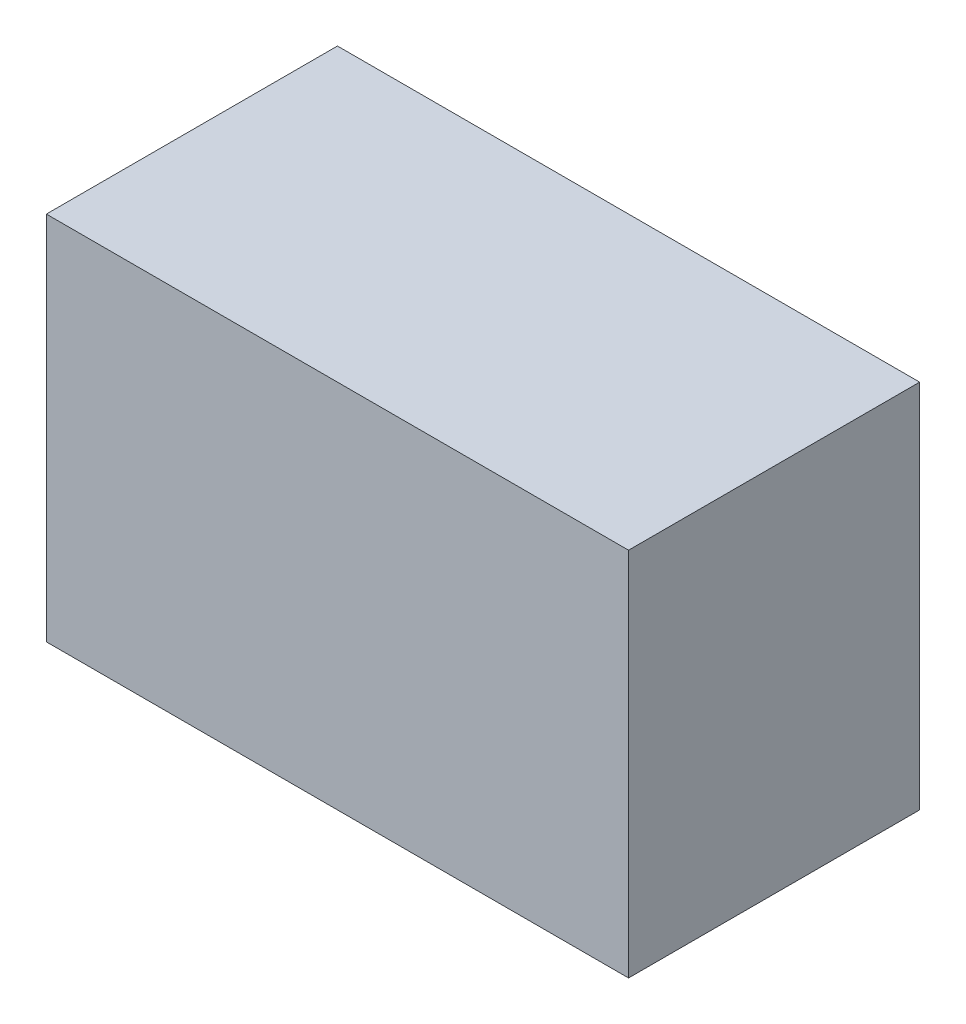
ISO-10303-21;
HEADER;
FILE_DESCRIPTION(('STEP AP214'),'2;1');
FILE_NAME('part.step','',(''),(''),'','','');
FILE_SCHEMA(('AUTOMOTIVE_DESIGN { 1 0 10303 214 1 1 1 1 }'));
ENDSEC;
DATA;
#1=APPLICATION_CONTEXT('core data for automotive mechanical design processes');
#2=APPLICATION_PROTOCOL_DEFINITION('international standard','automotive_design',2000,#1);
#3=PRODUCT_CONTEXT('',#1,'mechanical');
#4=PRODUCT('Part','Part','',(#3));
#5=PRODUCT_RELATED_PRODUCT_CATEGORY('part','',(#4));
#6=PRODUCT_DEFINITION_FORMATION('','',#4);
#7=PRODUCT_DEFINITION_CONTEXT('part definition',#1,'design');
#8=PRODUCT_DEFINITION('design','',#6,#7);
#9=PRODUCT_DEFINITION_SHAPE('','',#8);
#10=(LENGTH_UNIT() NAMED_UNIT(*) SI_UNIT(.MILLI.,.METRE.));
#11=(NAMED_UNIT(*) PLANE_ANGLE_UNIT() SI_UNIT($,.RADIAN.));
#12=(NAMED_UNIT(*) SI_UNIT($,.STERADIAN.) SOLID_ANGLE_UNIT());
#13=UNCERTAINTY_MEASURE_WITH_UNIT(LENGTH_MEASURE(1.E-05),#10,'distance_accuracy_value','');
#14=(GEOMETRIC_REPRESENTATION_CONTEXT(3) GLOBAL_UNCERTAINTY_ASSIGNED_CONTEXT((#13)) GLOBAL_UNIT_ASSIGNED_CONTEXT((#10,
#11,#12)) REPRESENTATION_CONTEXT('',''));
#15=CARTESIAN_POINT('',(0.,0.,0.));
#16=DIRECTION('',(0.,0.,1.));
#17=DIRECTION('',(1.,0.,0.));
#18=AXIS2_PLACEMENT_3D('',#15,#16,#17);
#19=CARTESIAN_POINT('',(0.54999636,0.35000184,0.5499989));
#20=DIRECTION('',(0.,0.,1.));
#21=DIRECTION('',(1.,0.,0.));
#22=AXIS2_PLACEMENT_3D('',#19,#20,#21);
#23=PLANE('',#22);
#24=DIRECTION('',(1.,0.,0.));
#25=VECTOR('',#24,1.);
#26=CARTESIAN_POINT('',(0.55000398,-0.3499993,0.5499989));
#27=LINE('',#26,#25);
#28=CARTESIAN_POINT('',(0.550003979999991,-0.3499993,0.5499989));
#29=VERTEX_POINT('',#28);
#30=CARTESIAN_POINT('',(-0.55000398,-0.3499993,0.5499989));
#31=VERTEX_POINT('',#30);
#32=EDGE_CURVE('E57',#29,#31,#27,.F.);
#33=ORIENTED_EDGE('',*,*,#32,.F.);
#34=DIRECTION('',(-1.08856965440673E-05,0.999999999940751,0.));
#35=VECTOR('',#34,1.);
#36=CARTESIAN_POINT('',(0.54999636,0.35000184,0.5499989));
#37=LINE('',#36,#35);
#38=CARTESIAN_POINT('',(0.54999636,0.35000184,0.5499989));
#39=VERTEX_POINT('',#38);
#40=EDGE_CURVE('E70',#39,#29,#37,.F.);
#41=ORIENTED_EDGE('',*,*,#40,.F.);
#42=DIRECTION('',(1.,0.,0.));
#43=VECTOR('',#42,1.);
#44=CARTESIAN_POINT('',(-0.55000398,0.35000184,0.5499989));
#45=LINE('',#44,#43);
#46=CARTESIAN_POINT('',(-0.55000398,0.35000184,0.5499989));
#47=VERTEX_POINT('',#46);
#48=EDGE_CURVE('E19',#47,#39,#45,.T.);
#49=ORIENTED_EDGE('',*,*,#48,.F.);
#50=DIRECTION('',(0.,1.,0.));
#51=VECTOR('',#50,1.);
#52=CARTESIAN_POINT('',(-0.55000398,-0.3499993,0.5499989));
#53=LINE('',#52,#51);
#54=EDGE_CURVE('E52',#31,#47,#53,.T.);
#55=ORIENTED_EDGE('',*,*,#54,.F.);
#56=EDGE_LOOP('',(#33,#41,#49,#55));
#57=FACE_BOUND('',#56,.T.);
#58=ADVANCED_FACE('F16',(#57),#23,.T.);
#59=CARTESIAN_POINT('',(-0.55000398,0.35000184,0.));
#60=DIRECTION('',(0.,1.,0.));
#61=DIRECTION('',(0.,0.,1.));
#62=AXIS2_PLACEMENT_3D('',#59,#60,#61);
#63=PLANE('',#62);
#64=DIRECTION('',(0.,0.,1.));
#65=VECTOR('',#64,1.);
#66=CARTESIAN_POINT('',(0.54999636,0.35000184,0.));
#67=LINE('',#66,#65);
#68=CARTESIAN_POINT('',(0.54999636,0.35000184,0.));
#69=VERTEX_POINT('',#68);
#70=EDGE_CURVE('E65',#69,#39,#67,.T.);
#71=ORIENTED_EDGE('',*,*,#70,.F.);
#72=DIRECTION('',(1.,0.,0.));
#73=VECTOR('',#72,1.);
#74=CARTESIAN_POINT('',(-0.55000398,0.35000184,0.));
#75=LINE('',#74,#73);
#76=CARTESIAN_POINT('',(-0.55000398,0.35000184,0.));
#77=VERTEX_POINT('',#76);
#78=EDGE_CURVE('E73',#69,#77,#75,.F.);
#79=ORIENTED_EDGE('',*,*,#78,.T.);
#80=DIRECTION('',(0.,0.,1.));
#81=VECTOR('',#80,1.);
#82=CARTESIAN_POINT('',(-0.55000398,0.35000184,0.));
#83=LINE('',#82,#81);
#84=EDGE_CURVE('E66',#47,#77,#83,.F.);
#85=ORIENTED_EDGE('',*,*,#84,.F.);
#86=ORIENTED_EDGE('',*,*,#48,.T.);
#87=EDGE_LOOP('',(#71,#79,#85,#86));
#88=FACE_BOUND('',#87,.T.);
#89=ADVANCED_FACE('F63',(#88),#63,.T.);
#90=CARTESIAN_POINT('',(-0.55000398,-0.3499993,0.));
#91=DIRECTION('',(-1.,0.,0.));
#92=DIRECTION('',(0.,0.,1.));
#93=AXIS2_PLACEMENT_3D('',#90,#91,#92);
#94=PLANE('',#93);
#95=ORIENTED_EDGE('',*,*,#84,.T.);
#96=DIRECTION('',(0.,1.,0.));
#97=VECTOR('',#96,1.);
#98=CARTESIAN_POINT('',(-0.55000398,0.35000184,0.));
#99=LINE('',#98,#97);
#100=CARTESIAN_POINT('',(-0.55000398,-0.3499993,0.));
#101=VERTEX_POINT('',#100);
#102=EDGE_CURVE('E76',#77,#101,#99,.F.);
#103=ORIENTED_EDGE('',*,*,#102,.T.);
#104=DIRECTION('',(0.,0.,-1.));
#105=VECTOR('',#104,1.);
#106=CARTESIAN_POINT('',(-0.55000398,-0.3499993,0.));
#107=LINE('',#106,#105);
#108=EDGE_CURVE('E71',#31,#101,#107,.T.);
#109=ORIENTED_EDGE('',*,*,#108,.F.);
#110=ORIENTED_EDGE('',*,*,#54,.T.);
#111=EDGE_LOOP('',(#95,#103,#109,#110));
#112=FACE_BOUND('',#111,.T.);
#113=ADVANCED_FACE('F100',(#112),#94,.T.);
#114=CARTESIAN_POINT('',(0.55000398,-0.3499993,0.));
#115=DIRECTION('',(0.,-1.,0.));
#116=DIRECTION('',(0.,0.,-1.));
#117=AXIS2_PLACEMENT_3D('',#114,#115,#116);
#118=PLANE('',#117);
#119=ORIENTED_EDGE('',*,*,#108,.T.);
#120=DIRECTION('',(1.,0.,0.));
#121=VECTOR('',#120,1.);
#122=CARTESIAN_POINT('',(0.54999636,-0.3499993,0.));
#123=LINE('',#122,#121);
#124=CARTESIAN_POINT('',(0.550003979999991,-0.3499993,0.));
#125=VERTEX_POINT('',#124);
#126=EDGE_CURVE('E25',#101,#125,#123,.T.);
#127=ORIENTED_EDGE('',*,*,#126,.T.);
#128=DIRECTION('',(0.,0.,1.));
#129=VECTOR('',#128,1.);
#130=CARTESIAN_POINT('',(0.550003979999991,-0.3499993,0.));
#131=LINE('',#130,#129);
#132=EDGE_CURVE('E33',#29,#125,#131,.F.);
#133=ORIENTED_EDGE('',*,*,#132,.F.);
#134=ORIENTED_EDGE('',*,*,#32,.T.);
#135=EDGE_LOOP('',(#119,#127,#133,#134));
#136=FACE_BOUND('',#135,.T.);
#137=ADVANCED_FACE('F96',(#136),#118,.T.);
#138=CARTESIAN_POINT('',(0.54999636,0.35000184,0.));
#139=DIRECTION('',(0.999999999940751,1.08856965440673E-05,0.));
#140=DIRECTION('',(-1.08856965440673E-05,0.999999999940751,0.));
#141=AXIS2_PLACEMENT_3D('',#138,#139,#140);
#142=PLANE('',#141);
#143=ORIENTED_EDGE('',*,*,#132,.T.);
#144=DIRECTION('',(-1.08856965440673E-05,0.999999999940751,0.));
#145=VECTOR('',#144,1.);
#146=CARTESIAN_POINT('',(0.54999636,0.35000184,0.));
#147=LINE('',#146,#145);
#148=EDGE_CURVE('E11',#125,#69,#147,.T.);
#149=ORIENTED_EDGE('',*,*,#148,.T.);
#150=ORIENTED_EDGE('',*,*,#70,.T.);
#151=ORIENTED_EDGE('',*,*,#40,.T.);
#152=EDGE_LOOP('',(#143,#149,#150,#151));
#153=FACE_BOUND('',#152,.T.);
#154=ADVANCED_FACE('F69',(#153),#142,.T.);
#155=CARTESIAN_POINT('',(0.54999636,0.35000184,0.));
#156=DIRECTION('',(0.,0.,1.));
#157=DIRECTION('',(1.,0.,0.));
#158=AXIS2_PLACEMENT_3D('',#155,#156,#157);
#159=PLANE('',#158);
#160=ORIENTED_EDGE('',*,*,#126,.F.);
#161=ORIENTED_EDGE('',*,*,#102,.F.);
#162=ORIENTED_EDGE('',*,*,#78,.F.);
#163=ORIENTED_EDGE('',*,*,#148,.F.);
#164=EDGE_LOOP('',(#160,#161,#162,#163));
#165=FACE_BOUND('',#164,.T.);
#166=ADVANCED_FACE('F99',(#165),#159,.F.);
#167=CLOSED_SHELL('',(#58,#89,#113,#137,#154,#166));
#168=MANIFOLD_SOLID_BREP('B1',#167);
#169=ADVANCED_BREP_SHAPE_REPRESENTATION('',(#18,#168),#14);
#170=SHAPE_DEFINITION_REPRESENTATION(#9,#169);
ENDSEC;
END-ISO-10303-21;
